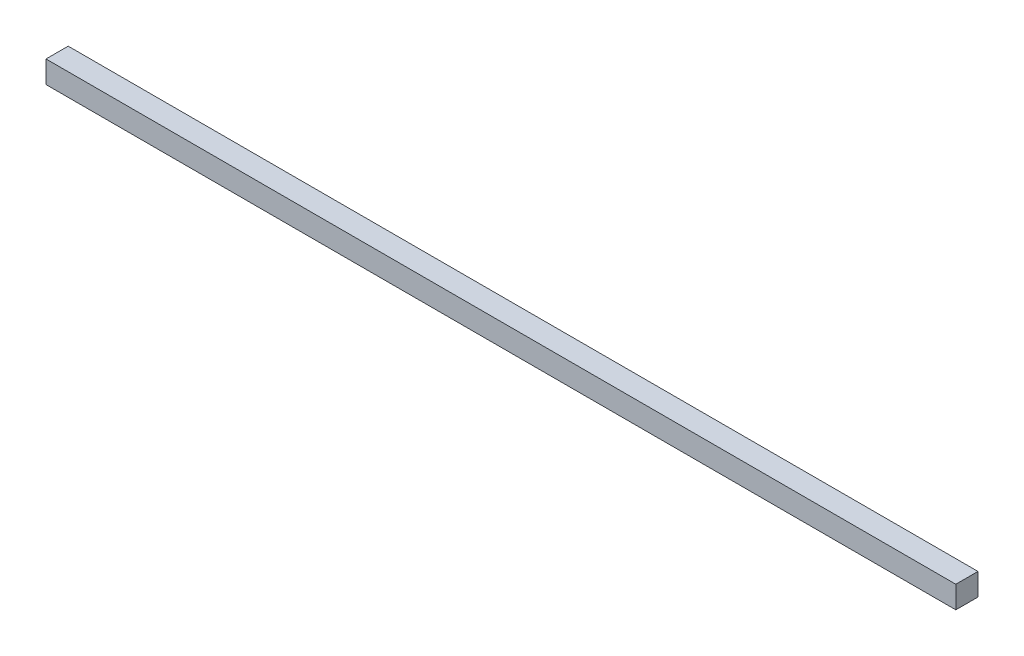
ISO-10303-21;
HEADER;
FILE_DESCRIPTION(('STEP AP214'),'2;1');
FILE_NAME('part.step','',(''),(''),'','','');
FILE_SCHEMA(('AUTOMOTIVE_DESIGN { 1 0 10303 214 1 1 1 1 }'));
ENDSEC;
DATA;
#1=APPLICATION_CONTEXT('core data for automotive mechanical design processes');
#2=APPLICATION_PROTOCOL_DEFINITION('international standard','automotive_design',2000,#1);
#3=PRODUCT_CONTEXT('',#1,'mechanical');
#4=PRODUCT('Part','Part','',(#3));
#5=PRODUCT_RELATED_PRODUCT_CATEGORY('part','',(#4));
#6=PRODUCT_DEFINITION_FORMATION('','',#4);
#7=PRODUCT_DEFINITION_CONTEXT('part definition',#1,'design');
#8=PRODUCT_DEFINITION('design','',#6,#7);
#9=PRODUCT_DEFINITION_SHAPE('','',#8);
#10=(LENGTH_UNIT() NAMED_UNIT(*) SI_UNIT(.MILLI.,.METRE.));
#11=(NAMED_UNIT(*) PLANE_ANGLE_UNIT() SI_UNIT($,.RADIAN.));
#12=(NAMED_UNIT(*) SI_UNIT($,.STERADIAN.) SOLID_ANGLE_UNIT());
#13=UNCERTAINTY_MEASURE_WITH_UNIT(LENGTH_MEASURE(1.E-05),#10,'distance_accuracy_value','');
#14=(GEOMETRIC_REPRESENTATION_CONTEXT(3) GLOBAL_UNCERTAINTY_ASSIGNED_CONTEXT((#13)) GLOBAL_UNIT_ASSIGNED_CONTEXT((#10,
#11,#12)) REPRESENTATION_CONTEXT('',''));
#15=CARTESIAN_POINT('',(0.,0.,0.));
#16=DIRECTION('',(0.,0.,1.));
#17=DIRECTION('',(1.,0.,0.));
#18=AXIS2_PLACEMENT_3D('',#15,#16,#17);
#19=CARTESIAN_POINT('',(-205.,10.,-4.99999999999998));
#20=DIRECTION('',(1.,0.,0.));
#21=DIRECTION('',(0.,0.,-1.));
#22=AXIS2_PLACEMENT_3D('',#19,#20,#21);
#23=PLANE('',#22);
#24=DIRECTION('',(0.,0.,1.));
#25=VECTOR('',#24,1.);
#26=CARTESIAN_POINT('',(-205.,0.,-4.99999999999998));
#27=LINE('',#26,#25);
#28=CARTESIAN_POINT('',(-205.,0.,-4.99999999999998));
#29=VERTEX_POINT('',#28);
#30=CARTESIAN_POINT('',(-205.,0.,5.));
#31=VERTEX_POINT('',#30);
#32=EDGE_CURVE('E97',#29,#31,#27,.T.);
#33=ORIENTED_EDGE('',*,*,#32,.T.);
#34=DIRECTION('',(0.,-1.,0.));
#35=VECTOR('',#34,1.);
#36=CARTESIAN_POINT('',(-205.,10.,5.));
#37=LINE('',#36,#35);
#38=CARTESIAN_POINT('',(-205.,10.,5.));
#39=VERTEX_POINT('',#38);
#40=EDGE_CURVE('E11',#39,#31,#37,.T.);
#41=ORIENTED_EDGE('',*,*,#40,.F.);
#42=DIRECTION('',(0.,0.,1.));
#43=VECTOR('',#42,1.);
#44=CARTESIAN_POINT('',(-205.,10.,-4.99999999999998));
#45=LINE('',#44,#43);
#46=CARTESIAN_POINT('',(-205.,10.,-4.99999999999998));
#47=VERTEX_POINT('',#46);
#48=EDGE_CURVE('E85',#47,#39,#45,.T.);
#49=ORIENTED_EDGE('',*,*,#48,.F.);
#50=DIRECTION('',(0.,-1.,0.));
#51=VECTOR('',#50,1.);
#52=CARTESIAN_POINT('',(-205.,10.,-4.99999999999998));
#53=LINE('',#52,#51);
#54=EDGE_CURVE('E93',#47,#29,#53,.T.);
#55=ORIENTED_EDGE('',*,*,#54,.T.);
#56=EDGE_LOOP('',(#33,#41,#49,#55));
#57=FACE_BOUND('',#56,.T.);
#58=ADVANCED_FACE('F34',(#57),#23,.F.);
#59=CARTESIAN_POINT('',(-205.,10.,5.));
#60=DIRECTION('',(0.,0.,-1.));
#61=DIRECTION('',(-1.,0.,0.));
#62=AXIS2_PLACEMENT_3D('',#59,#60,#61);
#63=PLANE('',#62);
#64=DIRECTION('',(1.,0.,0.));
#65=VECTOR('',#64,1.);
#66=CARTESIAN_POINT('',(-205.,0.,5.));
#67=LINE('',#66,#65);
#68=CARTESIAN_POINT('',(205.,0.,5.));
#69=VERTEX_POINT('',#68);
#70=EDGE_CURVE('E89',#31,#69,#67,.T.);
#71=ORIENTED_EDGE('',*,*,#70,.T.);
#72=DIRECTION('',(0.,-1.,0.));
#73=VECTOR('',#72,1.);
#74=CARTESIAN_POINT('',(205.,10.,5.));
#75=LINE('',#74,#73);
#76=CARTESIAN_POINT('',(205.,10.,5.));
#77=VERTEX_POINT('',#76);
#78=EDGE_CURVE('E42',#77,#69,#75,.T.);
#79=ORIENTED_EDGE('',*,*,#78,.F.);
#80=DIRECTION('',(1.,0.,0.));
#81=VECTOR('',#80,1.);
#82=CARTESIAN_POINT('',(-205.,10.,5.));
#83=LINE('',#82,#81);
#84=EDGE_CURVE('E80',#39,#77,#83,.T.);
#85=ORIENTED_EDGE('',*,*,#84,.F.);
#86=ORIENTED_EDGE('',*,*,#40,.T.);
#87=EDGE_LOOP('',(#71,#79,#85,#86));
#88=FACE_BOUND('',#87,.T.);
#89=ADVANCED_FACE('F88',(#88),#63,.F.);
#90=CARTESIAN_POINT('',(205.,10.,-4.99999999999998));
#91=DIRECTION('',(-1.,0.,0.));
#92=DIRECTION('',(0.,0.,1.));
#93=AXIS2_PLACEMENT_3D('',#90,#91,#92);
#94=PLANE('',#93);
#95=DIRECTION('',(0.,0.,-1.));
#96=VECTOR('',#95,1.);
#97=CARTESIAN_POINT('',(205.,0.,-4.99999999999998));
#98=LINE('',#97,#96);
#99=CARTESIAN_POINT('',(205.,0.,-4.99999999999998));
#100=VERTEX_POINT('',#99);
#101=EDGE_CURVE('E67',#69,#100,#98,.T.);
#102=ORIENTED_EDGE('',*,*,#101,.T.);
#103=DIRECTION('',(0.,-1.,0.));
#104=VECTOR('',#103,1.);
#105=CARTESIAN_POINT('',(205.,10.,-4.99999999999998));
#106=LINE('',#105,#104);
#107=CARTESIAN_POINT('',(205.,10.,-4.99999999999998));
#108=VERTEX_POINT('',#107);
#109=EDGE_CURVE('E90',#108,#100,#106,.T.);
#110=ORIENTED_EDGE('',*,*,#109,.F.);
#111=DIRECTION('',(0.,0.,-1.));
#112=VECTOR('',#111,1.);
#113=CARTESIAN_POINT('',(205.,10.,-4.99999999999998));
#114=LINE('',#113,#112);
#115=EDGE_CURVE('E83',#77,#108,#114,.T.);
#116=ORIENTED_EDGE('',*,*,#115,.F.);
#117=ORIENTED_EDGE('',*,*,#78,.T.);
#118=EDGE_LOOP('',(#102,#110,#116,#117));
#119=FACE_BOUND('',#118,.T.);
#120=ADVANCED_FACE('F91',(#119),#94,.F.);
#121=CARTESIAN_POINT('',(-205.,10.,-4.99999999999998));
#122=DIRECTION('',(0.,0.,1.));
#123=DIRECTION('',(1.,0.,0.));
#124=AXIS2_PLACEMENT_3D('',#121,#122,#123);
#125=PLANE('',#124);
#126=DIRECTION('',(-1.,0.,0.));
#127=VECTOR('',#126,1.);
#128=CARTESIAN_POINT('',(-205.,0.,-4.99999999999998));
#129=LINE('',#128,#127);
#130=EDGE_CURVE('E73',#100,#29,#129,.T.);
#131=ORIENTED_EDGE('',*,*,#130,.T.);
#132=ORIENTED_EDGE('',*,*,#54,.F.);
#133=DIRECTION('',(-1.,0.,0.));
#134=VECTOR('',#133,1.);
#135=CARTESIAN_POINT('',(-205.,10.,-4.99999999999998));
#136=LINE('',#135,#134);
#137=EDGE_CURVE('E50',#108,#47,#136,.T.);
#138=ORIENTED_EDGE('',*,*,#137,.F.);
#139=ORIENTED_EDGE('',*,*,#109,.T.);
#140=EDGE_LOOP('',(#131,#132,#138,#139));
#141=FACE_BOUND('',#140,.T.);
#142=ADVANCED_FACE('F104',(#141),#125,.F.);
#143=CARTESIAN_POINT('',(0.,10.,0.));
#144=DIRECTION('',(0.,1.,0.));
#145=DIRECTION('',(0.,0.,1.));
#146=AXIS2_PLACEMENT_3D('',#143,#144,#145);
#147=PLANE('',#146);
#148=ORIENTED_EDGE('',*,*,#48,.T.);
#149=ORIENTED_EDGE('',*,*,#84,.T.);
#150=ORIENTED_EDGE('',*,*,#115,.T.);
#151=ORIENTED_EDGE('',*,*,#137,.T.);
#152=EDGE_LOOP('',(#148,#149,#150,#151));
#153=FACE_BOUND('',#152,.T.);
#154=ADVANCED_FACE('F81',(#153),#147,.T.);
#155=CARTESIAN_POINT('',(0.,0.,0.));
#156=DIRECTION('',(0.,1.,0.));
#157=DIRECTION('',(0.,0.,1.));
#158=AXIS2_PLACEMENT_3D('',#155,#156,#157);
#159=PLANE('',#158);
#160=ORIENTED_EDGE('',*,*,#32,.F.);
#161=ORIENTED_EDGE('',*,*,#130,.F.);
#162=ORIENTED_EDGE('',*,*,#101,.F.);
#163=ORIENTED_EDGE('',*,*,#70,.F.);
#164=EDGE_LOOP('',(#160,#161,#162,#163));
#165=FACE_BOUND('',#164,.T.);
#166=ADVANCED_FACE('F107',(#165),#159,.F.);
#167=CLOSED_SHELL('',(#58,#89,#120,#142,#154,#166));
#168=MANIFOLD_SOLID_BREP('B2',#167);
#169=ADVANCED_BREP_SHAPE_REPRESENTATION('',(#18,#168),#14);
#170=SHAPE_DEFINITION_REPRESENTATION(#9,#169);
ENDSEC;
END-ISO-10303-21;
